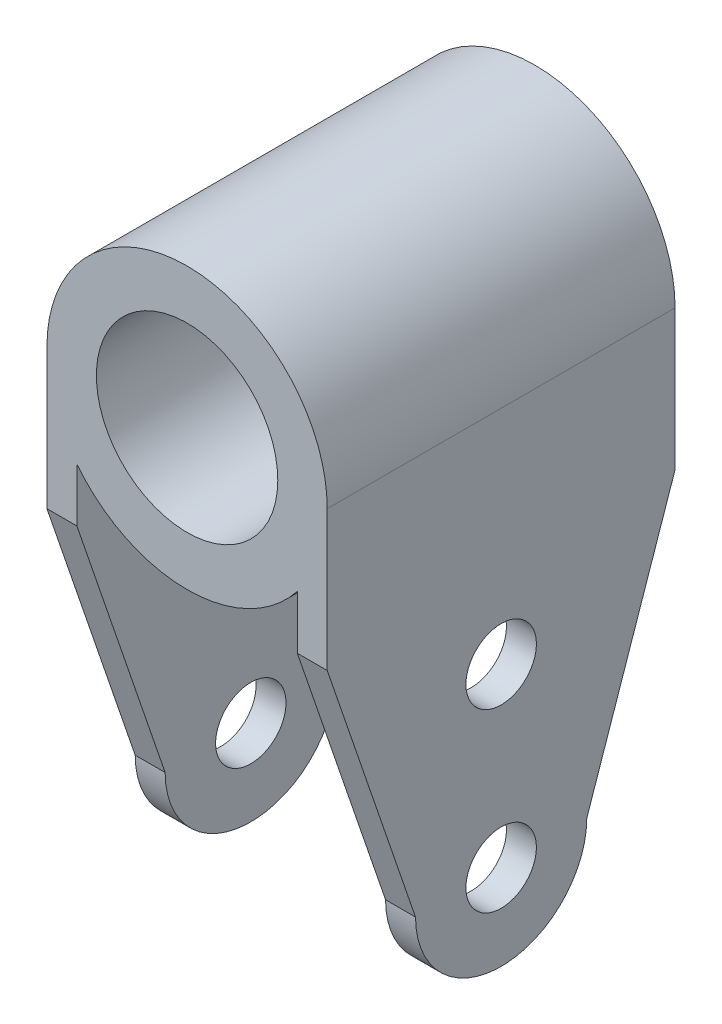
ISO-10303-21;
HEADER;
FILE_DESCRIPTION(('STEP AP214'),'2;1');
FILE_NAME('part.step','',(''),(''),'','','');
FILE_SCHEMA(('AUTOMOTIVE_DESIGN { 1 0 10303 214 1 1 1 1 }'));
ENDSEC;
DATA;
#1=APPLICATION_CONTEXT('core data for automotive mechanical design processes');
#2=APPLICATION_PROTOCOL_DEFINITION('international standard','automotive_design',2000,#1);
#3=PRODUCT_CONTEXT('',#1,'mechanical');
#4=PRODUCT('Part','Part','',(#3));
#5=PRODUCT_RELATED_PRODUCT_CATEGORY('part','',(#4));
#6=PRODUCT_DEFINITION_FORMATION('','',#4);
#7=PRODUCT_DEFINITION_CONTEXT('part definition',#1,'design');
#8=PRODUCT_DEFINITION('design','',#6,#7);
#9=PRODUCT_DEFINITION_SHAPE('','',#8);
#10=(LENGTH_UNIT() NAMED_UNIT(*) SI_UNIT(.MILLI.,.METRE.));
#11=(NAMED_UNIT(*) PLANE_ANGLE_UNIT() SI_UNIT($,.RADIAN.));
#12=(NAMED_UNIT(*) SI_UNIT($,.STERADIAN.) SOLID_ANGLE_UNIT());
#13=UNCERTAINTY_MEASURE_WITH_UNIT(LENGTH_MEASURE(1.E-05),#10,'distance_accuracy_value','');
#14=(GEOMETRIC_REPRESENTATION_CONTEXT(3) GLOBAL_UNCERTAINTY_ASSIGNED_CONTEXT((#13)) GLOBAL_UNIT_ASSIGNED_CONTEXT((#10,
#11,#12)) REPRESENTATION_CONTEXT('',''));
#15=CARTESIAN_POINT('',(0.,0.,0.));
#16=DIRECTION('',(0.,0.,1.));
#17=DIRECTION('',(1.,0.,0.));
#18=AXIS2_PLACEMENT_3D('',#15,#16,#17);
#19=CARTESIAN_POINT('',(-15.915,-15.915,39.5));
#20=DIRECTION('',(1.,0.,0.));
#21=DIRECTION('',(0.,1.,0.));
#22=AXIS2_PLACEMENT_3D('',#19,#20,#21);
#23=PLANE('',#22);
#24=CARTESIAN_POINT('',(-15.915,-45.175,19.75));
#25=DIRECTION('',(-1.,0.,0.));
#26=DIRECTION('',(0.,0.,1.));
#27=AXIS2_PLACEMENT_3D('',#24,#25,#26);
#28=CIRCLE('',#27,4.);
#29=CARTESIAN_POINT('',(-15.915,-45.175,23.75));
#30=VERTEX_POINT('',#29);
#31=EDGE_CURVE('E277',#30,#30,#28,.T.);
#32=ORIENTED_EDGE('',*,*,#31,.F.);
#33=EDGE_LOOP('',(#32));
#34=FACE_BOUND('',#33,.T.);
#35=CARTESIAN_POINT('',(-15.915,-25.175,19.75));
#36=DIRECTION('',(-1.,0.,0.));
#37=DIRECTION('',(0.,0.,1.));
#38=AXIS2_PLACEMENT_3D('',#35,#36,#37);
#39=CIRCLE('',#38,4.);
#40=CARTESIAN_POINT('',(-15.915,-25.175,23.75));
#41=VERTEX_POINT('',#40);
#42=EDGE_CURVE('E265',#41,#41,#39,.T.);
#43=ORIENTED_EDGE('',*,*,#42,.F.);
#44=EDGE_LOOP('',(#43));
#45=FACE_BOUND('',#44,.T.);
#46=CARTESIAN_POINT('',(-15.915,-45.175,19.75));
#47=DIRECTION('',(-1.,0.,0.));
#48=DIRECTION('',(0.,-1.,0.));
#49=AXIS2_PLACEMENT_3D('',#46,#47,#48);
#50=CIRCLE('',#49,9.725);
#51=CARTESIAN_POINT('',(-15.915,-45.175,10.025));
#52=VERTEX_POINT('',#51);
#53=CARTESIAN_POINT('',(-15.915,-45.175,29.475));
#54=VERTEX_POINT('',#53);
#55=EDGE_CURVE('E208',#52,#54,#50,.T.);
#56=ORIENTED_EDGE('',*,*,#55,.T.);
#57=DIRECTION('',(0.,-0.946015357558759,-0.324121803128043));
#58=VECTOR('',#57,1.);
#59=CARTESIAN_POINT('',(-15.915,-13.7836054594415,40.2302539394771));
#60=LINE('',#59,#58);
#61=CARTESIAN_POINT('',(-15.915,-15.915,39.5));
#62=VERTEX_POINT('',#61);
#63=EDGE_CURVE('E145',#62,#54,#60,.T.);
#64=ORIENTED_EDGE('',*,*,#63,.F.);
#65=DIRECTION('',(0.,-1.,0.));
#66=VECTOR('',#65,1.);
#67=CARTESIAN_POINT('',(-15.915,0.,39.5));
#68=LINE('',#67,#66);
#69=CARTESIAN_POINT('',(-15.915,0.,39.5));
#70=VERTEX_POINT('',#69);
#71=EDGE_CURVE('E239',#70,#62,#68,.T.);
#72=ORIENTED_EDGE('',*,*,#71,.F.);
#73=DIRECTION('',(0.,0.,-1.));
#74=VECTOR('',#73,1.);
#75=CARTESIAN_POINT('',(-15.915,0.,39.5));
#76=LINE('',#75,#74);
#77=CARTESIAN_POINT('',(-15.915,0.,0.));
#78=VERTEX_POINT('',#77);
#79=EDGE_CURVE('E11',#70,#78,#76,.T.);
#80=ORIENTED_EDGE('',*,*,#79,.T.);
#81=DIRECTION('',(0.,-1.,0.));
#82=VECTOR('',#81,1.);
#83=CARTESIAN_POINT('',(-15.915,-15.915,0.));
#84=LINE('',#83,#82);
#85=CARTESIAN_POINT('',(-15.915,-15.915,0.));
#86=VERTEX_POINT('',#85);
#87=EDGE_CURVE('E172',#78,#86,#84,.T.);
#88=ORIENTED_EDGE('',*,*,#87,.T.);
#89=DIRECTION('',(0.,-0.946015357558759,0.324121803128044));
#90=VECTOR('',#89,1.);
#91=CARTESIAN_POINT('',(-15.915,-1.67194942203024,-4.87992419836455));
#92=LINE('',#91,#90);
#93=EDGE_CURVE('E215',#86,#52,#92,.T.);
#94=ORIENTED_EDGE('',*,*,#93,.T.);
#95=EDGE_LOOP('',(#56,#64,#72,#80,#88,#94));
#96=FACE_BOUND('',#95,.T.);
#97=ADVANCED_FACE('F37',(#34,#45,#96),#23,.F.);
#98=CARTESIAN_POINT('',(-12.515,-54.9,39.5));
#99=DIRECTION('',(-1.,0.,0.));
#100=DIRECTION('',(0.,0.,1.));
#101=AXIS2_PLACEMENT_3D('',#98,#99,#100);
#102=PLANE('',#101);
#103=CARTESIAN_POINT('',(-12.515,-45.175,19.75));
#104=DIRECTION('',(-1.,0.,0.));
#105=DIRECTION('',(0.,0.,1.));
#106=AXIS2_PLACEMENT_3D('',#103,#104,#105);
#107=CIRCLE('',#106,3.99999999999999);
#108=CARTESIAN_POINT('',(-12.515,-45.175,23.75));
#109=VERTEX_POINT('',#108);
#110=EDGE_CURVE('E268',#109,#109,#107,.T.);
#111=ORIENTED_EDGE('',*,*,#110,.T.);
#112=EDGE_LOOP('',(#111));
#113=FACE_BOUND('',#112,.T.);
#114=CARTESIAN_POINT('',(-12.515,-25.175,19.75));
#115=DIRECTION('',(-1.,0.,0.));
#116=DIRECTION('',(0.,0.,1.));
#117=AXIS2_PLACEMENT_3D('',#114,#115,#116);
#118=CIRCLE('',#117,3.99999999999999);
#119=CARTESIAN_POINT('',(-12.515,-25.175,23.75));
#120=VERTEX_POINT('',#119);
#121=EDGE_CURVE('E259',#120,#120,#118,.T.);
#122=ORIENTED_EDGE('',*,*,#121,.T.);
#123=EDGE_LOOP('',(#122));
#124=FACE_BOUND('',#123,.T.);
#125=DIRECTION('',(0.,-0.946015357558759,-0.324121803128043));
#126=VECTOR('',#125,1.);
#127=CARTESIAN_POINT('',(-12.515,-50.804433036893,27.5462554273803));
#128=LINE('',#127,#126);
#129=CARTESIAN_POINT('',(-12.515,-15.915,39.5));
#130=VERTEX_POINT('',#129);
#131=CARTESIAN_POINT('',(-12.515,-45.175,29.475));
#132=VERTEX_POINT('',#131);
#133=EDGE_CURVE('E205',#130,#132,#128,.T.);
#134=ORIENTED_EDGE('',*,*,#133,.T.);
#135=CARTESIAN_POINT('',(-12.515,-45.175,19.75));
#136=DIRECTION('',(-1.,0.,0.));
#137=DIRECTION('',(0.,0.,1.));
#138=AXIS2_PLACEMENT_3D('',#135,#136,#137);
#139=CIRCLE('',#138,9.725);
#140=CARTESIAN_POINT('',(-12.515,-45.175,10.025));
#141=VERTEX_POINT('',#140);
#142=EDGE_CURVE('E231',#141,#132,#139,.T.);
#143=ORIENTED_EDGE('',*,*,#142,.F.);
#144=DIRECTION('',(0.,-0.946015357558759,0.324121803128044));
#145=VECTOR('',#144,1.);
#146=CARTESIAN_POINT('',(-12.515,-62.9160890743042,16.1034148315072));
#147=LINE('',#146,#145);
#148=CARTESIAN_POINT('',(-12.515,-15.915,0.));
#149=VERTEX_POINT('',#148);
#150=EDGE_CURVE('E228',#149,#141,#147,.T.);
#151=ORIENTED_EDGE('',*,*,#150,.F.);
#152=DIRECTION('',(0.,1.,0.));
#153=VECTOR('',#152,1.);
#154=CARTESIAN_POINT('',(-12.515,-54.9,0.));
#155=LINE('',#154,#153);
#156=CARTESIAN_POINT('',(-12.515,-9.83168347741119,0.));
#157=VERTEX_POINT('',#156);
#158=EDGE_CURVE('E176',#149,#157,#155,.T.);
#159=ORIENTED_EDGE('',*,*,#158,.T.);
#160=DIRECTION('',(0.,0.,-1.));
#161=VECTOR('',#160,1.);
#162=CARTESIAN_POINT('',(-12.515,-9.83168347741119,39.5));
#163=LINE('',#162,#161);
#164=CARTESIAN_POINT('',(-12.515,-9.83168347741119,39.5));
#165=VERTEX_POINT('',#164);
#166=EDGE_CURVE('E45',#165,#157,#163,.T.);
#167=ORIENTED_EDGE('',*,*,#166,.F.);
#168=DIRECTION('',(0.,1.,0.));
#169=VECTOR('',#168,1.);
#170=CARTESIAN_POINT('',(-12.515,-54.9,39.5));
#171=LINE('',#170,#169);
#172=EDGE_CURVE('E242',#130,#165,#171,.T.);
#173=ORIENTED_EDGE('',*,*,#172,.F.);
#174=EDGE_LOOP('',(#134,#143,#151,#159,#167,#173));
#175=FACE_BOUND('',#174,.T.);
#176=ADVANCED_FACE('F244',(#113,#124,#175),#102,.F.);
#177=CARTESIAN_POINT('',(12.515,-54.9,39.5));
#178=DIRECTION('',(1.,0.,0.));
#179=DIRECTION('',(0.,1.,0.));
#180=AXIS2_PLACEMENT_3D('',#177,#178,#179);
#181=PLANE('',#180);
#182=CARTESIAN_POINT('',(12.515,-45.175,19.75));
#183=DIRECTION('',(1.,0.,0.));
#184=DIRECTION('',(0.,1.,0.));
#185=AXIS2_PLACEMENT_3D('',#182,#183,#184);
#186=CIRCLE('',#185,3.99999999999999);
#187=CARTESIAN_POINT('',(12.515,-41.175,19.75));
#188=VERTEX_POINT('',#187);
#189=EDGE_CURVE('E271',#188,#188,#186,.T.);
#190=ORIENTED_EDGE('',*,*,#189,.T.);
#191=EDGE_LOOP('',(#190));
#192=FACE_BOUND('',#191,.T.);
#193=CARTESIAN_POINT('',(12.515,-25.175,19.75));
#194=DIRECTION('',(1.,0.,0.));
#195=DIRECTION('',(0.,1.,0.));
#196=AXIS2_PLACEMENT_3D('',#193,#194,#195);
#197=CIRCLE('',#196,3.99999999999999);
#198=CARTESIAN_POINT('',(12.515,-21.175,19.75));
#199=VERTEX_POINT('',#198);
#200=EDGE_CURVE('E255',#199,#199,#197,.T.);
#201=ORIENTED_EDGE('',*,*,#200,.T.);
#202=EDGE_LOOP('',(#201));
#203=FACE_BOUND('',#202,.T.);
#204=CARTESIAN_POINT('',(12.515,-45.175,19.75));
#205=DIRECTION('',(1.,0.,0.));
#206=DIRECTION('',(0.,1.,0.));
#207=AXIS2_PLACEMENT_3D('',#204,#205,#206);
#208=CIRCLE('',#207,9.725);
#209=CARTESIAN_POINT('',(12.515,-45.175,29.475));
#210=VERTEX_POINT('',#209);
#211=CARTESIAN_POINT('',(12.515,-45.175,10.025));
#212=VERTEX_POINT('',#211);
#213=EDGE_CURVE('E204',#210,#212,#208,.T.);
#214=ORIENTED_EDGE('',*,*,#213,.F.);
#215=DIRECTION('',(0.,0.946015357558759,0.324121803128043));
#216=VECTOR('',#215,1.);
#217=CARTESIAN_POINT('',(12.515,-50.804433036893,27.5462554273803));
#218=LINE('',#217,#216);
#219=CARTESIAN_POINT('',(12.515,-15.915,39.5));
#220=VERTEX_POINT('',#219);
#221=EDGE_CURVE('E203',#210,#220,#218,.T.);
#222=ORIENTED_EDGE('',*,*,#221,.T.);
#223=DIRECTION('',(0.,-1.,0.));
#224=VECTOR('',#223,1.);
#225=CARTESIAN_POINT('',(12.515,-54.9,39.5));
#226=LINE('',#225,#224);
#227=CARTESIAN_POINT('',(12.515,-9.83168347741118,39.5));
#228=VERTEX_POINT('',#227);
#229=EDGE_CURVE('E155',#228,#220,#226,.T.);
#230=ORIENTED_EDGE('',*,*,#229,.F.);
#231=DIRECTION('',(0.,0.,-1.));
#232=VECTOR('',#231,1.);
#233=CARTESIAN_POINT('',(12.515,-9.83168347741118,39.5));
#234=LINE('',#233,#232);
#235=CARTESIAN_POINT('',(12.515,-9.83168347741118,0.));
#236=VERTEX_POINT('',#235);
#237=EDGE_CURVE('E163',#228,#236,#234,.T.);
#238=ORIENTED_EDGE('',*,*,#237,.T.);
#239=DIRECTION('',(0.,-1.,0.));
#240=VECTOR('',#239,1.);
#241=CARTESIAN_POINT('',(12.515,-54.9,0.));
#242=LINE('',#241,#240);
#243=CARTESIAN_POINT('',(12.515,-15.915,0.));
#244=VERTEX_POINT('',#243);
#245=EDGE_CURVE('E182',#236,#244,#242,.T.);
#246=ORIENTED_EDGE('',*,*,#245,.T.);
#247=DIRECTION('',(0.,0.946015357558759,-0.324121803128044));
#248=VECTOR('',#247,1.);
#249=CARTESIAN_POINT('',(12.515,-62.9160890743042,16.1034148315072));
#250=LINE('',#249,#248);
#251=EDGE_CURVE('E223',#212,#244,#250,.T.);
#252=ORIENTED_EDGE('',*,*,#251,.F.);
#253=EDGE_LOOP('',(#214,#222,#230,#238,#246,#252));
#254=FACE_BOUND('',#253,.T.);
#255=ADVANCED_FACE('F201',(#192,#203,#254),#181,.F.);
#256=CARTESIAN_POINT('',(15.915,0.,39.5));
#257=DIRECTION('',(-1.,0.,0.));
#258=DIRECTION('',(0.,-1.,0.));
#259=AXIS2_PLACEMENT_3D('',#256,#257,#258);
#260=PLANE('',#259);
#261=CARTESIAN_POINT('',(15.915,-45.175,19.75));
#262=DIRECTION('',(-1.,0.,0.));
#263=DIRECTION('',(0.,0.,1.));
#264=AXIS2_PLACEMENT_3D('',#261,#262,#263);
#265=CIRCLE('',#264,3.99999999999999);
#266=CARTESIAN_POINT('',(15.915,-45.175,23.75));
#267=VERTEX_POINT('',#266);
#268=EDGE_CURVE('E274',#267,#267,#265,.T.);
#269=ORIENTED_EDGE('',*,*,#268,.T.);
#270=EDGE_LOOP('',(#269));
#271=FACE_BOUND('',#270,.T.);
#272=CARTESIAN_POINT('',(15.915,-25.175,19.75));
#273=DIRECTION('',(-1.,0.,0.));
#274=DIRECTION('',(0.,0.,1.));
#275=AXIS2_PLACEMENT_3D('',#272,#273,#274);
#276=CIRCLE('',#275,3.99999999999999);
#277=CARTESIAN_POINT('',(15.915,-25.175,23.75));
#278=VERTEX_POINT('',#277);
#279=EDGE_CURVE('E262',#278,#278,#276,.T.);
#280=ORIENTED_EDGE('',*,*,#279,.T.);
#281=EDGE_LOOP('',(#280));
#282=FACE_BOUND('',#281,.T.);
#283=DIRECTION('',(0.,-0.946015357558759,-0.324121803128043));
#284=VECTOR('',#283,1.);
#285=CARTESIAN_POINT('',(15.915,-13.7836054594415,40.2302539394771));
#286=LINE('',#285,#284);
#287=CARTESIAN_POINT('',(15.915,-15.915,39.5));
#288=VERTEX_POINT('',#287);
#289=CARTESIAN_POINT('',(15.915,-45.175,29.475));
#290=VERTEX_POINT('',#289);
#291=EDGE_CURVE('E133',#288,#290,#286,.T.);
#292=ORIENTED_EDGE('',*,*,#291,.T.);
#293=CARTESIAN_POINT('',(15.915,-45.175,19.75));
#294=DIRECTION('',(-1.,0.,0.));
#295=DIRECTION('',(0.,-1.,0.));
#296=AXIS2_PLACEMENT_3D('',#293,#294,#295);
#297=CIRCLE('',#296,9.725);
#298=CARTESIAN_POINT('',(15.915,-45.175,10.025));
#299=VERTEX_POINT('',#298);
#300=EDGE_CURVE('E212',#299,#290,#297,.T.);
#301=ORIENTED_EDGE('',*,*,#300,.F.);
#302=DIRECTION('',(0.,-0.946015357558759,0.324121803128044));
#303=VECTOR('',#302,1.);
#304=CARTESIAN_POINT('',(15.915,-1.67194942203023,-4.87992419836455));
#305=LINE('',#304,#303);
#306=CARTESIAN_POINT('',(15.915,-15.915,0.));
#307=VERTEX_POINT('',#306);
#308=EDGE_CURVE('E214',#307,#299,#305,.T.);
#309=ORIENTED_EDGE('',*,*,#308,.F.);
#310=DIRECTION('',(0.,1.,0.));
#311=VECTOR('',#310,1.);
#312=CARTESIAN_POINT('',(15.915,0.,0.));
#313=LINE('',#312,#311);
#314=CARTESIAN_POINT('',(15.915,0.,0.));
#315=VERTEX_POINT('',#314);
#316=EDGE_CURVE('E185',#307,#315,#313,.T.);
#317=ORIENTED_EDGE('',*,*,#316,.T.);
#318=DIRECTION('',(0.,0.,-1.));
#319=VECTOR('',#318,1.);
#320=CARTESIAN_POINT('',(15.915,0.,39.5));
#321=LINE('',#320,#319);
#322=CARTESIAN_POINT('',(15.915,0.,39.5));
#323=VERTEX_POINT('',#322);
#324=EDGE_CURVE('E160',#323,#315,#321,.T.);
#325=ORIENTED_EDGE('',*,*,#324,.F.);
#326=DIRECTION('',(0.,1.,0.));
#327=VECTOR('',#326,1.);
#328=CARTESIAN_POINT('',(15.915,-27.45,39.5));
#329=LINE('',#328,#327);
#330=EDGE_CURVE('E152',#288,#323,#329,.T.);
#331=ORIENTED_EDGE('',*,*,#330,.F.);
#332=EDGE_LOOP('',(#292,#301,#309,#317,#325,#331));
#333=FACE_BOUND('',#332,.T.);
#334=ADVANCED_FACE('F158',(#271,#282,#333),#260,.F.);
#335=CARTESIAN_POINT('',(0.,0.,0.));
#336=DIRECTION('',(0.,0.,1.));
#337=DIRECTION('',(1.,0.,0.));
#338=AXIS2_PLACEMENT_3D('',#335,#336,#337);
#339=PLANE('',#338);
#340=CARTESIAN_POINT('',(0.,0.,0.));
#341=DIRECTION('',(0.,0.,1.));
#342=DIRECTION('',(1.,0.,0.));
#343=AXIS2_PLACEMENT_3D('',#340,#341,#342);
#344=CIRCLE('',#343,10.3);
#345=CARTESIAN_POINT('',(10.3,0.,0.));
#346=VERTEX_POINT('',#345);
#347=EDGE_CURVE('E233',#346,#346,#344,.T.);
#348=ORIENTED_EDGE('',*,*,#347,.T.);
#349=EDGE_LOOP('',(#348));
#350=FACE_BOUND('',#349,.T.);
#351=DIRECTION('',(-1.,0.,0.));
#352=VECTOR('',#351,1.);
#353=CARTESIAN_POINT('',(15.915,-15.915,0.));
#354=LINE('',#353,#352);
#355=EDGE_CURVE('E60',#149,#86,#354,.T.);
#356=ORIENTED_EDGE('',*,*,#355,.T.);
#357=ORIENTED_EDGE('',*,*,#87,.F.);
#358=CARTESIAN_POINT('',(0.,0.,0.));
#359=DIRECTION('',(0.,0.,1.));
#360=DIRECTION('',(1.,0.,0.));
#361=AXIS2_PLACEMENT_3D('',#358,#359,#360);
#362=CIRCLE('',#361,15.915);
#363=EDGE_CURVE('E169',#315,#78,#362,.T.);
#364=ORIENTED_EDGE('',*,*,#363,.F.);
#365=ORIENTED_EDGE('',*,*,#316,.F.);
#366=EDGE_CURVE('E221',#307,#244,#354,.T.);
#367=ORIENTED_EDGE('',*,*,#366,.T.);
#368=ORIENTED_EDGE('',*,*,#245,.F.);
#369=CARTESIAN_POINT('',(0.,0.,0.));
#370=DIRECTION('',(0.,0.,1.));
#371=DIRECTION('',(1.,0.,0.));
#372=AXIS2_PLACEMENT_3D('',#369,#370,#371);
#373=CIRCLE('',#372,15.915);
#374=CARTESIAN_POINT('',(0.,-15.915,0.));
#375=VERTEX_POINT('',#374);
#376=EDGE_CURVE('E178',#375,#236,#373,.T.);
#377=ORIENTED_EDGE('',*,*,#376,.F.);
#378=EDGE_CURVE('E179',#157,#375,#373,.T.);
#379=ORIENTED_EDGE('',*,*,#378,.F.);
#380=ORIENTED_EDGE('',*,*,#158,.F.);
#381=EDGE_LOOP('',(#356,#357,#364,#365,#367,#368,#377,#379,#380));
#382=FACE_BOUND('',#381,.T.);
#383=ADVANCED_FACE('F197',(#350,#382),#339,.F.);
#384=CARTESIAN_POINT('',(0.,0.,39.5));
#385=DIRECTION('',(0.,0.,1.));
#386=DIRECTION('',(1.,0.,0.));
#387=AXIS2_PLACEMENT_3D('',#384,#385,#386);
#388=PLANE('',#387);
#389=DIRECTION('',(-1.,0.,0.));
#390=VECTOR('',#389,1.);
#391=CARTESIAN_POINT('',(15.915,-15.915,39.5));
#392=LINE('',#391,#390);
#393=EDGE_CURVE('E137',#288,#220,#392,.T.);
#394=ORIENTED_EDGE('',*,*,#393,.F.);
#395=ORIENTED_EDGE('',*,*,#330,.T.);
#396=CARTESIAN_POINT('',(0.,0.,39.5));
#397=DIRECTION('',(0.,0.,1.));
#398=DIRECTION('',(1.,0.,0.));
#399=AXIS2_PLACEMENT_3D('',#396,#397,#398);
#400=CIRCLE('',#399,15.915);
#401=EDGE_CURVE('E186',#323,#70,#400,.T.);
#402=ORIENTED_EDGE('',*,*,#401,.T.);
#403=ORIENTED_EDGE('',*,*,#71,.T.);
#404=EDGE_CURVE('E144',#130,#62,#392,.T.);
#405=ORIENTED_EDGE('',*,*,#404,.F.);
#406=ORIENTED_EDGE('',*,*,#172,.T.);
#407=CARTESIAN_POINT('',(0.,0.,39.5));
#408=DIRECTION('',(0.,0.,1.));
#409=DIRECTION('',(1.,0.,0.));
#410=AXIS2_PLACEMENT_3D('',#407,#408,#409);
#411=CIRCLE('',#410,15.915);
#412=CARTESIAN_POINT('',(0.,-15.915,39.5));
#413=VERTEX_POINT('',#412);
#414=EDGE_CURVE('E165',#165,#413,#411,.T.);
#415=ORIENTED_EDGE('',*,*,#414,.T.);
#416=EDGE_CURVE('E52',#413,#228,#411,.T.);
#417=ORIENTED_EDGE('',*,*,#416,.T.);
#418=ORIENTED_EDGE('',*,*,#229,.T.);
#419=EDGE_LOOP('',(#394,#395,#402,#403,#405,#406,#415,#417,#418));
#420=FACE_BOUND('',#419,.T.);
#421=CARTESIAN_POINT('',(0.,0.,39.5));
#422=DIRECTION('',(0.,0.,1.));
#423=DIRECTION('',(1.,0.,0.));
#424=AXIS2_PLACEMENT_3D('',#421,#422,#423);
#425=CIRCLE('',#424,10.3);
#426=CARTESIAN_POINT('',(10.3,0.,39.5));
#427=VERTEX_POINT('',#426);
#428=EDGE_CURVE('E173',#427,#427,#425,.T.);
#429=ORIENTED_EDGE('',*,*,#428,.F.);
#430=EDGE_LOOP('',(#429));
#431=FACE_BOUND('',#430,.T.);
#432=ADVANCED_FACE('F149',(#420,#431),#388,.T.);
#433=CARTESIAN_POINT('',(0.,0.,39.5));
#434=DIRECTION('',(0.,0.,-1.));
#435=DIRECTION('',(-1.,0.,0.));
#436=AXIS2_PLACEMENT_3D('',#433,#434,#435);
#437=CYLINDRICAL_SURFACE('',#436,15.915);
#438=ORIENTED_EDGE('',*,*,#363,.T.);
#439=ORIENTED_EDGE('',*,*,#79,.F.);
#440=ORIENTED_EDGE('',*,*,#401,.F.);
#441=ORIENTED_EDGE('',*,*,#324,.T.);
#442=EDGE_LOOP('',(#438,#439,#440,#441));
#443=FACE_BOUND('',#442,.T.);
#444=ADVANCED_FACE('F39',(#443),#437,.T.);
#445=CARTESIAN_POINT('',(0.,0.,39.5));
#446=DIRECTION('',(0.,0.,-1.));
#447=DIRECTION('',(-1.,0.,0.));
#448=AXIS2_PLACEMENT_3D('',#445,#446,#447);
#449=CYLINDRICAL_SURFACE('',#448,15.915);
#450=ORIENTED_EDGE('',*,*,#378,.T.);
#451=ORIENTED_EDGE('',*,*,#376,.T.);
#452=ORIENTED_EDGE('',*,*,#237,.F.);
#453=ORIENTED_EDGE('',*,*,#416,.F.);
#454=ORIENTED_EDGE('',*,*,#414,.F.);
#455=ORIENTED_EDGE('',*,*,#166,.T.);
#456=EDGE_LOOP('',(#450,#451,#452,#453,#454,#455));
#457=FACE_BOUND('',#456,.T.);
#458=ADVANCED_FACE('F192',(#457),#449,.T.);
#459=CARTESIAN_POINT('',(0.,0.,39.5));
#460=DIRECTION('',(0.,0.,-1.));
#461=DIRECTION('',(-1.,0.,0.));
#462=AXIS2_PLACEMENT_3D('',#459,#460,#461);
#463=CYLINDRICAL_SURFACE('',#462,10.3);
#464=ORIENTED_EDGE('',*,*,#428,.T.);
#465=EDGE_LOOP('',(#464));
#466=FACE_BOUND('',#465,.T.);
#467=ORIENTED_EDGE('',*,*,#347,.F.);
#468=EDGE_LOOP('',(#467));
#469=FACE_BOUND('',#468,.T.);
#470=ADVANCED_FACE('F307',(#466,#469),#463,.F.);
#471=CARTESIAN_POINT('',(15.915,-1.67194942203023,-4.87992419836455));
#472=DIRECTION('',(0.,-0.324121803128044,-0.946015357558759));
#473=DIRECTION('',(0.,0.946015357558759,-0.324121803128044));
#474=AXIS2_PLACEMENT_3D('',#471,#472,#473);
#475=PLANE('',#474);
#476=ORIENTED_EDGE('',*,*,#251,.T.);
#477=ORIENTED_EDGE('',*,*,#366,.F.);
#478=ORIENTED_EDGE('',*,*,#308,.T.);
#479=DIRECTION('',(-1.,0.,0.));
#480=VECTOR('',#479,1.);
#481=CARTESIAN_POINT('',(15.915,-45.175,10.025));
#482=LINE('',#481,#480);
#483=EDGE_CURVE('E224',#299,#212,#482,.T.);
#484=ORIENTED_EDGE('',*,*,#483,.T.);
#485=EDGE_LOOP('',(#476,#477,#478,#484));
#486=FACE_BOUND('',#485,.T.);
#487=ADVANCED_FACE('F298',(#486),#475,.T.);
#488=CARTESIAN_POINT('',(15.915,-45.175,19.75));
#489=DIRECTION('',(-1.,0.,0.));
#490=DIRECTION('',(0.,-1.,0.));
#491=AXIS2_PLACEMENT_3D('',#488,#489,#490);
#492=CYLINDRICAL_SURFACE('',#491,9.725);
#493=ORIENTED_EDGE('',*,*,#213,.T.);
#494=ORIENTED_EDGE('',*,*,#483,.F.);
#495=ORIENTED_EDGE('',*,*,#300,.T.);
#496=DIRECTION('',(-1.,0.,0.));
#497=VECTOR('',#496,1.);
#498=CARTESIAN_POINT('',(15.915,-45.175,29.475));
#499=LINE('',#498,#497);
#500=EDGE_CURVE('E140',#290,#210,#499,.T.);
#501=ORIENTED_EDGE('',*,*,#500,.T.);
#502=EDGE_LOOP('',(#493,#494,#495,#501));
#503=FACE_BOUND('',#502,.T.);
#504=ADVANCED_FACE('F300',(#503),#492,.T.);
#505=ORIENTED_EDGE('',*,*,#142,.T.);
#506=EDGE_CURVE('E156',#132,#54,#499,.T.);
#507=ORIENTED_EDGE('',*,*,#506,.T.);
#508=ORIENTED_EDGE('',*,*,#55,.F.);
#509=EDGE_CURVE('E217',#141,#52,#482,.T.);
#510=ORIENTED_EDGE('',*,*,#509,.F.);
#511=EDGE_LOOP('',(#505,#507,#508,#510));
#512=FACE_BOUND('',#511,.T.);
#513=ADVANCED_FACE('F289',(#512),#492,.T.);
#514=ORIENTED_EDGE('',*,*,#150,.T.);
#515=ORIENTED_EDGE('',*,*,#509,.T.);
#516=ORIENTED_EDGE('',*,*,#93,.F.);
#517=ORIENTED_EDGE('',*,*,#355,.F.);
#518=EDGE_LOOP('',(#514,#515,#516,#517));
#519=FACE_BOUND('',#518,.T.);
#520=ADVANCED_FACE('F290',(#519),#475,.T.);
#521=CARTESIAN_POINT('',(15.915,-13.7836054594415,40.2302539394771));
#522=DIRECTION('',(0.,0.324121803128043,-0.946015357558759));
#523=DIRECTION('',(0.,0.946015357558759,0.324121803128043));
#524=AXIS2_PLACEMENT_3D('',#521,#522,#523);
#525=PLANE('',#524);
#526=ORIENTED_EDGE('',*,*,#404,.T.);
#527=ORIENTED_EDGE('',*,*,#63,.T.);
#528=ORIENTED_EDGE('',*,*,#506,.F.);
#529=ORIENTED_EDGE('',*,*,#133,.F.);
#530=EDGE_LOOP('',(#526,#527,#528,#529));
#531=FACE_BOUND('',#530,.T.);
#532=ADVANCED_FACE('F248',(#531),#525,.F.);
#533=ORIENTED_EDGE('',*,*,#500,.F.);
#534=ORIENTED_EDGE('',*,*,#291,.F.);
#535=ORIENTED_EDGE('',*,*,#393,.T.);
#536=ORIENTED_EDGE('',*,*,#221,.F.);
#537=EDGE_LOOP('',(#533,#534,#535,#536));
#538=FACE_BOUND('',#537,.T.);
#539=ADVANCED_FACE('F135',(#538),#525,.F.);
#540=CARTESIAN_POINT('',(-15.915,-25.175,19.75));
#541=DIRECTION('',(-1.,0.,0.));
#542=DIRECTION('',(0.,0.,1.));
#543=AXIS2_PLACEMENT_3D('',#540,#541,#542);
#544=CYLINDRICAL_SURFACE('',#543,3.99999999999999);
#545=ORIENTED_EDGE('',*,*,#279,.F.);
#546=EDGE_LOOP('',(#545));
#547=FACE_BOUND('',#546,.T.);
#548=ORIENTED_EDGE('',*,*,#200,.F.);
#549=EDGE_LOOP('',(#548));
#550=FACE_BOUND('',#549,.T.);
#551=ADVANCED_FACE('F338',(#547,#550),#544,.F.);
#552=ORIENTED_EDGE('',*,*,#42,.T.);
#553=EDGE_LOOP('',(#552));
#554=FACE_BOUND('',#553,.T.);
#555=ORIENTED_EDGE('',*,*,#121,.F.);
#556=EDGE_LOOP('',(#555));
#557=FACE_BOUND('',#556,.T.);
#558=ADVANCED_FACE('F335',(#554,#557),#544,.F.);
#559=CARTESIAN_POINT('',(-15.915,-45.175,19.75));
#560=DIRECTION('',(-1.,0.,0.));
#561=DIRECTION('',(0.,0.,1.));
#562=AXIS2_PLACEMENT_3D('',#559,#560,#561);
#563=CYLINDRICAL_SURFACE('',#562,3.99999999999999);
#564=ORIENTED_EDGE('',*,*,#268,.F.);
#565=EDGE_LOOP('',(#564));
#566=FACE_BOUND('',#565,.T.);
#567=ORIENTED_EDGE('',*,*,#189,.F.);
#568=EDGE_LOOP('',(#567));
#569=FACE_BOUND('',#568,.T.);
#570=ADVANCED_FACE('F337',(#566,#569),#563,.F.);
#571=ORIENTED_EDGE('',*,*,#31,.T.);
#572=EDGE_LOOP('',(#571));
#573=FACE_BOUND('',#572,.T.);
#574=ORIENTED_EDGE('',*,*,#110,.F.);
#575=EDGE_LOOP('',(#574));
#576=FACE_BOUND('',#575,.T.);
#577=ADVANCED_FACE('F281',(#573,#576),#563,.F.);
#578=CLOSED_SHELL('',(#97,#176,#255,#334,#383,#432,#444,#458,#470,#487,#504,#513,#520,#532,#539,
#551,#558,#570,#577));
#579=MANIFOLD_SOLID_BREP('B2',#578);
#580=ADVANCED_BREP_SHAPE_REPRESENTATION('',(#18,#579),#14);
#581=SHAPE_DEFINITION_REPRESENTATION(#9,#580);
ENDSEC;
END-ISO-10303-21;
